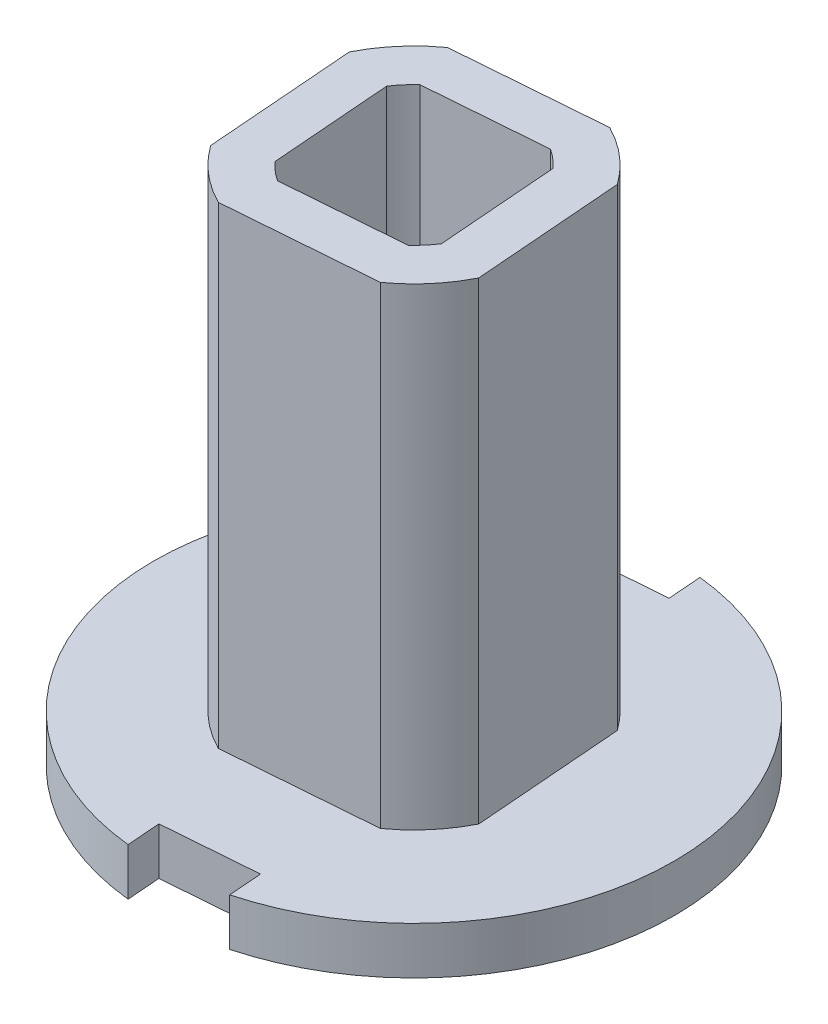
ISO-10303-21;
HEADER;
FILE_DESCRIPTION(('STEP AP214'),'2;1');
FILE_NAME('part.step','',(''),(''),'','','');
FILE_SCHEMA(('AUTOMOTIVE_DESIGN { 1 0 10303 214 1 1 1 1 }'));
ENDSEC;
DATA;
#1=APPLICATION_CONTEXT('core data for automotive mechanical design processes');
#2=APPLICATION_PROTOCOL_DEFINITION('international standard','automotive_design',2000,#1);
#3=PRODUCT_CONTEXT('',#1,'mechanical');
#4=PRODUCT('Part','Part','',(#3));
#5=PRODUCT_RELATED_PRODUCT_CATEGORY('part','',(#4));
#6=PRODUCT_DEFINITION_FORMATION('','',#4);
#7=PRODUCT_DEFINITION_CONTEXT('part definition',#1,'design');
#8=PRODUCT_DEFINITION('design','',#6,#7);
#9=PRODUCT_DEFINITION_SHAPE('','',#8);
#10=(LENGTH_UNIT() NAMED_UNIT(*) SI_UNIT(.MILLI.,.METRE.));
#11=(NAMED_UNIT(*) PLANE_ANGLE_UNIT() SI_UNIT($,.RADIAN.));
#12=(NAMED_UNIT(*) SI_UNIT($,.STERADIAN.) SOLID_ANGLE_UNIT());
#13=UNCERTAINTY_MEASURE_WITH_UNIT(LENGTH_MEASURE(1.E-05),#10,'distance_accuracy_value','');
#14=(GEOMETRIC_REPRESENTATION_CONTEXT(3) GLOBAL_UNCERTAINTY_ASSIGNED_CONTEXT((#13)) GLOBAL_UNIT_ASSIGNED_CONTEXT((#10,
#11,#12)) REPRESENTATION_CONTEXT('',''));
#15=CARTESIAN_POINT('',(0.,0.,0.));
#16=DIRECTION('',(0.,0.,1.));
#17=DIRECTION('',(1.,0.,0.));
#18=AXIS2_PLACEMENT_3D('',#15,#16,#17);
#19=CARTESIAN_POINT('',(0.996970266549163,124.994845223857,-0.0777835947814385));
#20=DIRECTION('',(-0.996970266549047,0.,0.0777835947814291));
#21=DIRECTION('',(0.0777835947814291,0.,0.996970266549047));
#22=AXIS2_PLACEMENT_3D('',#19,#20,#21);
#23=PLANE('',#22);
#24=DIRECTION('',(0.0777835947814291,0.,0.996970266549047));
#25=VECTOR('',#24,1.);
#26=CARTESIAN_POINT('',(0.996970266549163,125.994845223857,-0.0777835947814381));
#27=LINE('',#26,#25);
#28=CARTESIAN_POINT('',(0.576291157487637,125.994845223857,-5.46972471901473));
#29=VERTEX_POINT('',#28);
#30=CARTESIAN_POINT('',(0.631387371076454,125.994845223857,-4.76354384756187));
#31=VERTEX_POINT('',#30);
#32=EDGE_CURVE('E302',#29,#31,#27,.T.);
#33=ORIENTED_EDGE('',*,*,#32,.F.);
#34=DIRECTION('',(0.,1.,0.));
#35=VECTOR('',#34,1.);
#36=CARTESIAN_POINT('',(0.576291157487637,124.994845223857,-5.46972471901473));
#37=LINE('',#36,#35);
#38=CARTESIAN_POINT('',(0.576291157487637,124.994845223857,-5.46972471901473));
#39=VERTEX_POINT('',#38);
#40=EDGE_CURVE('E11',#39,#29,#37,.T.);
#41=ORIENTED_EDGE('',*,*,#40,.F.);
#42=DIRECTION('',(0.0777835947814291,0.,0.996970266549047));
#43=VECTOR('',#42,1.);
#44=CARTESIAN_POINT('',(0.996970266549163,124.994845223857,-0.0777835947814385));
#45=LINE('',#44,#43);
#46=CARTESIAN_POINT('',(0.631387371076454,124.994845223857,-4.76354384756187));
#47=VERTEX_POINT('',#46);
#48=EDGE_CURVE('E335',#39,#47,#45,.T.);
#49=ORIENTED_EDGE('',*,*,#48,.T.);
#50=DIRECTION('',(0.,1.,0.));
#51=VECTOR('',#50,1.);
#52=CARTESIAN_POINT('',(0.631387371076454,124.994845223857,-4.76354384756187));
#53=LINE('',#52,#51);
#54=EDGE_CURVE('E354',#47,#31,#53,.T.);
#55=ORIENTED_EDGE('',*,*,#54,.T.);
#56=EDGE_LOOP('',(#33,#41,#49,#55));
#57=FACE_BOUND('',#56,.T.);
#58=ADVANCED_FACE('F41',(#57),#23,.T.);
#59=CARTESIAN_POINT('',(1.23455057964104E-13,124.994845223857,0.));
#60=DIRECTION('',(0.,1.,0.));
#61=DIRECTION('',(0.,0.,1.));
#62=AXIS2_PLACEMENT_3D('',#59,#60,#61);
#63=CYLINDRICAL_SURFACE('',#62,5.49999999999984);
#64=CARTESIAN_POINT('',(1.2358989284748E-13,125.994845223857,0.));
#65=DIRECTION('',(0.,-1.,0.));
#66=DIRECTION('',(0.,0.,-1.));
#67=AXIS2_PLACEMENT_3D('',#64,#65,#66);
#68=CIRCLE('',#67,5.49999999999984);
#69=CARTESIAN_POINT('',(1.4176493756107,125.994845223857,5.31415752945204));
#70=VERTEX_POINT('',#69);
#71=EDGE_CURVE('E357',#29,#70,#68,.T.);
#72=ORIENTED_EDGE('',*,*,#71,.T.);
#73=DIRECTION('',(0.,1.,0.));
#74=VECTOR('',#73,1.);
#75=CARTESIAN_POINT('',(1.4176493756107,124.994845223857,5.31415752945204));
#76=LINE('',#75,#74);
#77=CARTESIAN_POINT('',(1.4176493756107,124.994845223857,5.31415752945204));
#78=VERTEX_POINT('',#77);
#79=EDGE_CURVE('E48',#78,#70,#76,.T.);
#80=ORIENTED_EDGE('',*,*,#79,.F.);
#81=CARTESIAN_POINT('',(1.23455057964104E-13,124.994845223857,0.));
#82=DIRECTION('',(0.,-1.,0.));
#83=DIRECTION('',(0.,0.,-1.));
#84=AXIS2_PLACEMENT_3D('',#81,#82,#83);
#85=CIRCLE('',#84,5.49999999999984);
#86=EDGE_CURVE('E338',#39,#78,#85,.T.);
#87=ORIENTED_EDGE('',*,*,#86,.F.);
#88=ORIENTED_EDGE('',*,*,#40,.T.);
#89=EDGE_LOOP('',(#72,#80,#87,#88));
#90=FACE_BOUND('',#89,.T.);
#91=ADVANCED_FACE('F425',(#90),#63,.T.);
#92=CARTESIAN_POINT('',(0.996970266549163,124.994845223857,-0.0777835947814384));
#93=DIRECTION('',(0.996970266549047,0.,-0.0777835947814289));
#94=DIRECTION('',(-0.0777835947814289,0.,-0.996970266549047));
#95=AXIS2_PLACEMENT_3D('',#92,#93,#94);
#96=PLANE('',#95);
#97=DIRECTION('',(-0.0777835947814289,0.,-0.996970266549047));
#98=VECTOR('',#97,1.);
#99=CARTESIAN_POINT('',(0.996970266549163,125.994845223857,-0.077783594781438));
#100=LINE('',#99,#98);
#101=CARTESIAN_POINT('',(1.36255316202189,125.994845223857,4.60797665799917));
#102=VERTEX_POINT('',#101);
#103=EDGE_CURVE('E359',#70,#102,#100,.T.);
#104=ORIENTED_EDGE('',*,*,#103,.T.);
#105=DIRECTION('',(0.,1.,0.));
#106=VECTOR('',#105,1.);
#107=CARTESIAN_POINT('',(1.36255316202189,124.994845223857,4.60797665799917));
#108=LINE('',#107,#106);
#109=CARTESIAN_POINT('',(1.36255316202189,124.994845223857,4.60797665799917));
#110=VERTEX_POINT('',#109);
#111=EDGE_CURVE('E384',#110,#102,#108,.T.);
#112=ORIENTED_EDGE('',*,*,#111,.F.);
#113=DIRECTION('',(-0.0777835947814289,0.,-0.996970266549047));
#114=VECTOR('',#113,1.);
#115=CARTESIAN_POINT('',(0.996970266549163,124.994845223857,-0.0777835947814384));
#116=LINE('',#115,#114);
#117=EDGE_CURVE('E341',#78,#110,#116,.T.);
#118=ORIENTED_EDGE('',*,*,#117,.F.);
#119=ORIENTED_EDGE('',*,*,#79,.T.);
#120=EDGE_LOOP('',(#104,#112,#118,#119));
#121=FACE_BOUND('',#120,.T.);
#122=ADVANCED_FACE('F390',(#121),#96,.F.);
#123=CARTESIAN_POINT('',(0.365582895472724,124.994845223857,4.68576025278061));
#124=DIRECTION('',(0.0777835947814291,0.,0.996970266549047));
#125=DIRECTION('',(0.996970266549047,0.,-0.0777835947814291));
#126=AXIS2_PLACEMENT_3D('',#123,#124,#125);
#127=PLANE('',#126);
#128=DIRECTION('',(0.996970266549047,0.,-0.0777835947814291));
#129=VECTOR('',#128,1.);
#130=CARTESIAN_POINT('',(0.365582895472724,125.994845223857,4.68576025278061));
#131=LINE('',#130,#129);
#132=CARTESIAN_POINT('',(-0.631387371076207,125.994845223857,4.76354384756204));
#133=VERTEX_POINT('',#132);
#134=EDGE_CURVE('E363',#133,#102,#131,.T.);
#135=ORIENTED_EDGE('',*,*,#134,.F.);
#136=DIRECTION('',(0.,1.,0.));
#137=VECTOR('',#136,1.);
#138=CARTESIAN_POINT('',(-0.631387371076208,124.994845223857,4.76354384756204));
#139=LINE('',#138,#137);
#140=CARTESIAN_POINT('',(-0.631387371076208,124.994845223857,4.76354384756204));
#141=VERTEX_POINT('',#140);
#142=EDGE_CURVE('E382',#141,#133,#139,.T.);
#143=ORIENTED_EDGE('',*,*,#142,.F.);
#144=DIRECTION('',(0.996970266549047,0.,-0.0777835947814291));
#145=VECTOR('',#144,1.);
#146=CARTESIAN_POINT('',(0.365582895472724,124.994845223857,4.68576025278061));
#147=LINE('',#146,#145);
#148=EDGE_CURVE('E344',#141,#110,#147,.T.);
#149=ORIENTED_EDGE('',*,*,#148,.T.);
#150=ORIENTED_EDGE('',*,*,#111,.T.);
#151=EDGE_LOOP('',(#135,#143,#149,#150));
#152=FACE_BOUND('',#151,.T.);
#153=ADVANCED_FACE('F402',(#152),#127,.T.);
#154=CARTESIAN_POINT('',(-0.996970266548929,124.994845223857,0.077783594781419));
#155=DIRECTION('',(0.996970266549047,0.,-0.0777835947814286));
#156=DIRECTION('',(-0.0777835947814286,0.,-0.996970266549047));
#157=AXIS2_PLACEMENT_3D('',#154,#155,#156);
#158=PLANE('',#157);
#159=DIRECTION('',(-0.0777835947814286,0.,-0.996970266549047));
#160=VECTOR('',#159,1.);
#161=CARTESIAN_POINT('',(-0.996970266548929,125.994845223857,0.0777835947814194));
#162=LINE('',#161,#160);
#163=CARTESIAN_POINT('',(-0.576291157487391,125.994845223857,5.4697247190149));
#164=VERTEX_POINT('',#163);
#165=EDGE_CURVE('E366',#164,#133,#162,.T.);
#166=ORIENTED_EDGE('',*,*,#165,.F.);
#167=DIRECTION('',(0.,1.,0.));
#168=VECTOR('',#167,1.);
#169=CARTESIAN_POINT('',(-0.576291157487391,124.994845223857,5.4697247190149));
#170=LINE('',#169,#168);
#171=CARTESIAN_POINT('',(-0.576291157487391,124.994845223857,5.4697247190149));
#172=VERTEX_POINT('',#171);
#173=EDGE_CURVE('E380',#172,#164,#170,.T.);
#174=ORIENTED_EDGE('',*,*,#173,.F.);
#175=DIRECTION('',(-0.0777835947814286,0.,-0.996970266549047));
#176=VECTOR('',#175,1.);
#177=CARTESIAN_POINT('',(-0.996970266548929,124.994845223857,0.077783594781419));
#178=LINE('',#177,#176);
#179=EDGE_CURVE('E347',#172,#141,#178,.T.);
#180=ORIENTED_EDGE('',*,*,#179,.T.);
#181=ORIENTED_EDGE('',*,*,#142,.T.);
#182=EDGE_LOOP('',(#166,#174,#180,#181));
#183=FACE_BOUND('',#182,.T.);
#184=ADVANCED_FACE('F409',(#183),#158,.T.);
#185=CARTESIAN_POINT('',(-1.41764937561046,125.994845223857,-5.31415752945187));
#186=VERTEX_POINT('',#185);
#187=EDGE_CURVE('E360',#164,#186,#68,.T.);
#188=ORIENTED_EDGE('',*,*,#187,.T.);
#189=DIRECTION('',(0.,1.,0.));
#190=VECTOR('',#189,1.);
#191=CARTESIAN_POINT('',(-1.41764937561046,124.994845223857,-5.31415752945187));
#192=LINE('',#191,#190);
#193=CARTESIAN_POINT('',(-1.41764937561046,124.994845223857,-5.31415752945187));
#194=VERTEX_POINT('',#193);
#195=EDGE_CURVE('E377',#194,#186,#192,.T.);
#196=ORIENTED_EDGE('',*,*,#195,.F.);
#197=EDGE_CURVE('E342',#172,#194,#85,.T.);
#198=ORIENTED_EDGE('',*,*,#197,.F.);
#199=ORIENTED_EDGE('',*,*,#173,.T.);
#200=EDGE_LOOP('',(#188,#196,#198,#199));
#201=FACE_BOUND('',#200,.T.);
#202=ADVANCED_FACE('F413',(#201),#63,.T.);
#203=CARTESIAN_POINT('',(-0.99697026654893,124.994845223857,0.0777835947814197));
#204=DIRECTION('',(-0.996970266549047,0.,0.0777835947814292));
#205=DIRECTION('',(0.0777835947814292,0.,0.996970266549047));
#206=AXIS2_PLACEMENT_3D('',#203,#204,#205);
#207=PLANE('',#206);
#208=DIRECTION('',(0.0777835947814292,0.,0.996970266549047));
#209=VECTOR('',#208,1.);
#210=CARTESIAN_POINT('',(-0.99697026654893,125.994845223857,0.0777835947814201));
#211=LINE('',#210,#209);
#212=CARTESIAN_POINT('',(-1.36255316202164,125.994845223857,-4.60797665799901));
#213=VERTEX_POINT('',#212);
#214=EDGE_CURVE('E369',#186,#213,#211,.T.);
#215=ORIENTED_EDGE('',*,*,#214,.T.);
#216=DIRECTION('',(0.,1.,0.));
#217=VECTOR('',#216,1.);
#218=CARTESIAN_POINT('',(-1.36255316202164,124.994845223857,-4.60797665799901));
#219=LINE('',#218,#217);
#220=CARTESIAN_POINT('',(-1.36255316202164,124.994845223857,-4.60797665799901));
#221=VERTEX_POINT('',#220);
#222=EDGE_CURVE('E374',#221,#213,#219,.T.);
#223=ORIENTED_EDGE('',*,*,#222,.F.);
#224=DIRECTION('',(0.0777835947814292,0.,0.996970266549047));
#225=VECTOR('',#224,1.);
#226=CARTESIAN_POINT('',(-0.99697026654893,124.994845223857,0.0777835947814197));
#227=LINE('',#226,#225);
#228=EDGE_CURVE('E350',#194,#221,#227,.T.);
#229=ORIENTED_EDGE('',*,*,#228,.F.);
#230=ORIENTED_EDGE('',*,*,#195,.T.);
#231=EDGE_LOOP('',(#215,#223,#229,#230));
#232=FACE_BOUND('',#231,.T.);
#233=ADVANCED_FACE('F419',(#232),#207,.F.);
#234=CARTESIAN_POINT('',(-0.36558289547271,124.994845223857,-4.68576025278043));
#235=DIRECTION('',(0.0777835947814291,0.,0.996970266549047));
#236=DIRECTION('',(0.996970266549047,0.,-0.0777835947814291));
#237=AXIS2_PLACEMENT_3D('',#234,#235,#236);
#238=PLANE('',#237);
#239=DIRECTION('',(0.996970266549047,0.,-0.0777835947814291));
#240=VECTOR('',#239,1.);
#241=CARTESIAN_POINT('',(-0.36558289547271,125.994845223857,-4.68576025278043));
#242=LINE('',#241,#240);
#243=EDGE_CURVE('E339',#213,#31,#242,.T.);
#244=ORIENTED_EDGE('',*,*,#243,.T.);
#245=ORIENTED_EDGE('',*,*,#54,.F.);
#246=DIRECTION('',(0.996970266549047,0.,-0.0777835947814291));
#247=VECTOR('',#246,1.);
#248=CARTESIAN_POINT('',(-0.36558289547271,124.994845223857,-4.68576025278043));
#249=LINE('',#248,#247);
#250=EDGE_CURVE('E352',#221,#47,#249,.T.);
#251=ORIENTED_EDGE('',*,*,#250,.F.);
#252=ORIENTED_EDGE('',*,*,#222,.T.);
#253=EDGE_LOOP('',(#244,#245,#251,#252));
#254=FACE_BOUND('',#253,.T.);
#255=ADVANCED_FACE('F423',(#254),#238,.F.);
#256=CARTESIAN_POINT('',(0.,124.994845223857,0.));
#257=DIRECTION('',(0.,-1.,0.));
#258=DIRECTION('',(0.,0.,-1.));
#259=AXIS2_PLACEMENT_3D('',#256,#257,#258);
#260=PLANE('',#259);
#261=ORIENTED_EDGE('',*,*,#48,.F.);
#262=ORIENTED_EDGE('',*,*,#86,.T.);
#263=ORIENTED_EDGE('',*,*,#117,.T.);
#264=ORIENTED_EDGE('',*,*,#148,.F.);
#265=ORIENTED_EDGE('',*,*,#179,.F.);
#266=ORIENTED_EDGE('',*,*,#197,.T.);
#267=ORIENTED_EDGE('',*,*,#228,.T.);
#268=ORIENTED_EDGE('',*,*,#250,.T.);
#269=EDGE_LOOP('',(#261,#262,#263,#264,#265,#266,#267,#268));
#270=FACE_BOUND('',#269,.T.);
#271=ADVANCED_FACE('F407',(#270),#260,.T.);
#272=CARTESIAN_POINT('',(0.,125.994845223857,0.));
#273=DIRECTION('',(0.,-1.,0.));
#274=DIRECTION('',(0.,0.,-1.));
#275=AXIS2_PLACEMENT_3D('',#272,#273,#274);
#276=PLANE('',#275);
#277=CARTESIAN_POINT('',(1.2358989284748E-13,125.994845223857,0.));
#278=DIRECTION('',(0.,-1.,0.));
#279=DIRECTION('',(0.,0.,-1.));
#280=AXIS2_PLACEMENT_3D('',#277,#278,#279);
#281=CIRCLE('',#280,3.082);
#282=CARTESIAN_POINT('',(-1.38447968775225,125.994845223857,2.75353227585978));
#283=VERTEX_POINT('',#282);
#284=CARTESIAN_POINT('',(-2.5054858801864,125.994845223857,1.79478815022449));
#285=VERTEX_POINT('',#284);
#286=EDGE_CURVE('E223',#283,#285,#281,.T.);
#287=ORIENTED_EDGE('',*,*,#286,.T.);
#288=DIRECTION('',(-0.0777835947814289,0.,-0.996970266549047));
#289=VECTOR('',#288,1.);
#290=CARTESIAN_POINT('',(-2.629509078023,125.994845223857,0.20515423123601));
#291=LINE('',#290,#289);
#292=CARTESIAN_POINT('',(-2.75353227585958,125.994845223857,-1.38447968775229));
#293=VERTEX_POINT('',#292);
#294=EDGE_CURVE('E280',#285,#293,#291,.T.);
#295=ORIENTED_EDGE('',*,*,#294,.T.);
#296=CARTESIAN_POINT('',(1.2358989284748E-13,125.994845223857,0.));
#297=DIRECTION('',(0.,-1.,0.));
#298=DIRECTION('',(0.,0.,-1.));
#299=AXIS2_PLACEMENT_3D('',#296,#297,#298);
#300=CIRCLE('',#299,3.082);
#301=CARTESIAN_POINT('',(-1.79478815022429,125.994845223857,-2.50548588018644));
#302=VERTEX_POINT('',#301);
#303=EDGE_CURVE('E283',#293,#302,#300,.T.);
#304=ORIENTED_EDGE('',*,*,#303,.T.);
#305=DIRECTION('',(0.996970266549047,0.,-0.077783594781429));
#306=VECTOR('',#305,1.);
#307=CARTESIAN_POINT('',(-0.205154231236012,125.994845223857,-2.62950907802302));
#308=LINE('',#307,#306);
#309=CARTESIAN_POINT('',(1.38447968775249,125.994845223857,-2.75353227585962));
#310=VERTEX_POINT('',#309);
#311=EDGE_CURVE('E286',#302,#310,#308,.T.);
#312=ORIENTED_EDGE('',*,*,#311,.T.);
#313=CARTESIAN_POINT('',(1.2358989284748E-13,125.994845223857,0.));
#314=DIRECTION('',(0.,-1.,0.));
#315=DIRECTION('',(0.,0.,-1.));
#316=AXIS2_PLACEMENT_3D('',#313,#314,#315);
#317=CIRCLE('',#316,3.082);
#318=CARTESIAN_POINT('',(2.50548588018665,125.994845223857,-1.79478815022433));
#319=VERTEX_POINT('',#318);
#320=EDGE_CURVE('E289',#310,#319,#317,.T.);
#321=ORIENTED_EDGE('',*,*,#320,.T.);
#322=DIRECTION('',(0.0777835947814297,0.,0.996970266549047));
#323=VECTOR('',#322,1.);
#324=CARTESIAN_POINT('',(2.62950907802323,125.994845223857,-0.20515423123603));
#325=LINE('',#324,#323);
#326=CARTESIAN_POINT('',(2.75353227585982,125.994845223857,1.38447968775245));
#327=VERTEX_POINT('',#326);
#328=EDGE_CURVE('E292',#319,#327,#325,.T.);
#329=ORIENTED_EDGE('',*,*,#328,.T.);
#330=CARTESIAN_POINT('',(1.2358989284748E-13,125.994845223857,0.));
#331=DIRECTION('',(0.,-1.,0.));
#332=DIRECTION('',(0.,0.,-1.));
#333=AXIS2_PLACEMENT_3D('',#330,#331,#332);
#334=CIRCLE('',#333,3.082);
#335=CARTESIAN_POINT('',(1.79478815022453,125.994845223857,2.50548588018661));
#336=VERTEX_POINT('',#335);
#337=EDGE_CURVE('E295',#327,#336,#334,.T.);
#338=ORIENTED_EDGE('',*,*,#337,.T.);
#339=DIRECTION('',(-0.996970266549047,0.,0.0777835947814291));
#340=VECTOR('',#339,1.);
#341=CARTESIAN_POINT('',(0.205154231236026,125.994845223857,2.6295090780232));
#342=LINE('',#341,#340);
#343=EDGE_CURVE('E226',#336,#283,#342,.T.);
#344=ORIENTED_EDGE('',*,*,#343,.T.);
#345=EDGE_LOOP('',(#287,#295,#304,#312,#321,#329,#338,#344));
#346=FACE_BOUND('',#345,.T.);
#347=ORIENTED_EDGE('',*,*,#32,.T.);
#348=ORIENTED_EDGE('',*,*,#243,.F.);
#349=ORIENTED_EDGE('',*,*,#214,.F.);
#350=ORIENTED_EDGE('',*,*,#187,.F.);
#351=ORIENTED_EDGE('',*,*,#165,.T.);
#352=ORIENTED_EDGE('',*,*,#134,.T.);
#353=ORIENTED_EDGE('',*,*,#103,.F.);
#354=ORIENTED_EDGE('',*,*,#71,.F.);
#355=EDGE_LOOP('',(#347,#348,#349,#350,#351,#352,#353,#354));
#356=FACE_BOUND('',#355,.T.);
#357=ADVANCED_FACE('F396',(#346,#356),#276,.F.);
#358=CARTESIAN_POINT('',(-2.62950907802299,135.994845223857,0.205154231236014));
#359=DIRECTION('',(-0.996970266549047,0.,0.0777835947814289));
#360=DIRECTION('',(0.0777835947814289,0.,0.996970266549047));
#361=AXIS2_PLACEMENT_3D('',#358,#359,#360);
#362=PLANE('',#361);
#363=ORIENTED_EDGE('',*,*,#294,.F.);
#364=DIRECTION('',(0.,-1.,0.));
#365=VECTOR('',#364,1.);
#366=CARTESIAN_POINT('',(-2.5054858801864,135.994845223857,1.7947881502245));
#367=LINE('',#366,#365);
#368=CARTESIAN_POINT('',(-2.5054858801864,135.994845223857,1.7947881502245));
#369=VERTEX_POINT('',#368);
#370=EDGE_CURVE('E300',#369,#285,#367,.T.);
#371=ORIENTED_EDGE('',*,*,#370,.F.);
#372=DIRECTION('',(-0.0777835947814289,0.,-0.996970266549047));
#373=VECTOR('',#372,1.);
#374=CARTESIAN_POINT('',(-2.62950907802299,135.994845223857,0.205154231236014));
#375=LINE('',#374,#373);
#376=CARTESIAN_POINT('',(-2.75353227585957,135.994845223857,-1.38447968775229));
#377=VERTEX_POINT('',#376);
#378=EDGE_CURVE('E240',#369,#377,#375,.T.);
#379=ORIENTED_EDGE('',*,*,#378,.T.);
#380=DIRECTION('',(0.,-1.,0.));
#381=VECTOR('',#380,1.);
#382=CARTESIAN_POINT('',(-2.75353227585957,135.994845223857,-1.38447968775229));
#383=LINE('',#382,#381);
#384=EDGE_CURVE('E316',#377,#293,#383,.T.);
#385=ORIENTED_EDGE('',*,*,#384,.T.);
#386=EDGE_LOOP('',(#363,#371,#379,#385));
#387=FACE_BOUND('',#386,.T.);
#388=ADVANCED_FACE('F497',(#387),#362,.T.);
#389=CARTESIAN_POINT('',(1.24938241681235E-13,135.994845223857,0.));
#390=DIRECTION('',(0.,-1.,0.));
#391=DIRECTION('',(0.,0.,-1.));
#392=AXIS2_PLACEMENT_3D('',#389,#390,#391);
#393=CYLINDRICAL_SURFACE('',#392,3.082);
#394=ORIENTED_EDGE('',*,*,#286,.F.);
#395=DIRECTION('',(0.,-1.,0.));
#396=VECTOR('',#395,1.);
#397=CARTESIAN_POINT('',(-1.38447968775224,135.994845223857,2.75353227585979));
#398=LINE('',#397,#396);
#399=CARTESIAN_POINT('',(-1.38447968775224,135.994845223857,2.75353227585979));
#400=VERTEX_POINT('',#399);
#401=EDGE_CURVE('E303',#400,#283,#398,.T.);
#402=ORIENTED_EDGE('',*,*,#401,.F.);
#403=CARTESIAN_POINT('',(1.24938241681235E-13,135.994845223857,0.));
#404=DIRECTION('',(0.,-1.,0.));
#405=DIRECTION('',(0.,0.,-1.));
#406=AXIS2_PLACEMENT_3D('',#403,#404,#405);
#407=CIRCLE('',#406,3.082);
#408=EDGE_CURVE('E219',#400,#369,#407,.T.);
#409=ORIENTED_EDGE('',*,*,#408,.T.);
#410=ORIENTED_EDGE('',*,*,#370,.T.);
#411=EDGE_LOOP('',(#394,#402,#409,#410));
#412=FACE_BOUND('',#411,.T.);
#413=ADVANCED_FACE('F513',(#412),#393,.T.);
#414=CARTESIAN_POINT('',(0.205154231236028,135.994845223857,2.62950907802321));
#415=DIRECTION('',(0.0777835947814291,0.,0.996970266549047));
#416=DIRECTION('',(0.996970266549047,0.,-0.0777835947814291));
#417=AXIS2_PLACEMENT_3D('',#414,#415,#416);
#418=PLANE('',#417);
#419=ORIENTED_EDGE('',*,*,#343,.F.);
#420=DIRECTION('',(0.,-1.,0.));
#421=VECTOR('',#420,1.);
#422=CARTESIAN_POINT('',(1.79478815022453,135.994845223857,2.50548588018661));
#423=LINE('',#422,#421);
#424=CARTESIAN_POINT('',(1.79478815022453,135.994845223857,2.50548588018661));
#425=VERTEX_POINT('',#424);
#426=EDGE_CURVE('E305',#425,#336,#423,.T.);
#427=ORIENTED_EDGE('',*,*,#426,.F.);
#428=DIRECTION('',(-0.996970266549047,0.,0.0777835947814291));
#429=VECTOR('',#428,1.);
#430=CARTESIAN_POINT('',(0.205154231236028,135.994845223857,2.62950907802321));
#431=LINE('',#430,#429);
#432=EDGE_CURVE('E258',#425,#400,#431,.T.);
#433=ORIENTED_EDGE('',*,*,#432,.T.);
#434=ORIENTED_EDGE('',*,*,#401,.T.);
#435=EDGE_LOOP('',(#419,#427,#433,#434));
#436=FACE_BOUND('',#435,.T.);
#437=ADVANCED_FACE('F523',(#436),#418,.T.);
#438=CARTESIAN_POINT('',(1.24938241681235E-13,135.994845223857,0.));
#439=DIRECTION('',(0.,-1.,0.));
#440=DIRECTION('',(0.,0.,-1.));
#441=AXIS2_PLACEMENT_3D('',#438,#439,#440);
#442=CYLINDRICAL_SURFACE('',#441,3.082);
#443=ORIENTED_EDGE('',*,*,#337,.F.);
#444=DIRECTION('',(0.,-1.,0.));
#445=VECTOR('',#444,1.);
#446=CARTESIAN_POINT('',(2.75353227585983,135.994845223857,1.38447968775246));
#447=LINE('',#446,#445);
#448=CARTESIAN_POINT('',(2.75353227585983,135.994845223857,1.38447968775246));
#449=VERTEX_POINT('',#448);
#450=EDGE_CURVE('E307',#449,#327,#447,.T.);
#451=ORIENTED_EDGE('',*,*,#450,.F.);
#452=CARTESIAN_POINT('',(1.24938241681235E-13,135.994845223857,0.));
#453=DIRECTION('',(0.,-1.,0.));
#454=DIRECTION('',(0.,0.,-1.));
#455=AXIS2_PLACEMENT_3D('',#452,#453,#454);
#456=CIRCLE('',#455,3.082);
#457=EDGE_CURVE('E255',#449,#425,#456,.T.);
#458=ORIENTED_EDGE('',*,*,#457,.T.);
#459=ORIENTED_EDGE('',*,*,#426,.T.);
#460=EDGE_LOOP('',(#443,#451,#458,#459));
#461=FACE_BOUND('',#460,.T.);
#462=ADVANCED_FACE('F532',(#461),#442,.T.);
#463=CARTESIAN_POINT('',(2.62950907802323,135.994845223857,-0.205154231236026));
#464=DIRECTION('',(0.996970266549047,0.,-0.0777835947814297));
#465=DIRECTION('',(-0.0777835947814297,0.,-0.996970266549047));
#466=AXIS2_PLACEMENT_3D('',#463,#464,#465);
#467=PLANE('',#466);
#468=ORIENTED_EDGE('',*,*,#328,.F.);
#469=DIRECTION('',(0.,-1.,0.));
#470=VECTOR('',#469,1.);
#471=CARTESIAN_POINT('',(2.50548588018665,135.994845223857,-1.79478815022432));
#472=LINE('',#471,#470);
#473=CARTESIAN_POINT('',(2.50548588018665,135.994845223857,-1.79478815022432));
#474=VERTEX_POINT('',#473);
#475=EDGE_CURVE('E309',#474,#319,#472,.T.);
#476=ORIENTED_EDGE('',*,*,#475,.F.);
#477=DIRECTION('',(0.0777835947814297,0.,0.996970266549047));
#478=VECTOR('',#477,1.);
#479=CARTESIAN_POINT('',(2.62950907802323,135.994845223857,-0.205154231236026));
#480=LINE('',#479,#478);
#481=EDGE_CURVE('E252',#474,#449,#480,.T.);
#482=ORIENTED_EDGE('',*,*,#481,.T.);
#483=ORIENTED_EDGE('',*,*,#450,.T.);
#484=EDGE_LOOP('',(#468,#476,#482,#483));
#485=FACE_BOUND('',#484,.T.);
#486=ADVANCED_FACE('F541',(#485),#467,.T.);
#487=CARTESIAN_POINT('',(1.24938241681235E-13,135.994845223857,0.));
#488=DIRECTION('',(0.,-1.,0.));
#489=DIRECTION('',(0.,0.,-1.));
#490=AXIS2_PLACEMENT_3D('',#487,#488,#489);
#491=CYLINDRICAL_SURFACE('',#490,3.082);
#492=ORIENTED_EDGE('',*,*,#320,.F.);
#493=DIRECTION('',(0.,-1.,0.));
#494=VECTOR('',#493,1.);
#495=CARTESIAN_POINT('',(1.3844796877525,135.994845223857,-2.75353227585961));
#496=LINE('',#495,#494);
#497=CARTESIAN_POINT('',(1.3844796877525,135.994845223857,-2.75353227585961));
#498=VERTEX_POINT('',#497);
#499=EDGE_CURVE('E311',#498,#310,#496,.T.);
#500=ORIENTED_EDGE('',*,*,#499,.F.);
#501=CARTESIAN_POINT('',(1.24938241681235E-13,135.994845223857,0.));
#502=DIRECTION('',(0.,-1.,0.));
#503=DIRECTION('',(0.,0.,-1.));
#504=AXIS2_PLACEMENT_3D('',#501,#502,#503);
#505=CIRCLE('',#504,3.082);
#506=EDGE_CURVE('E249',#498,#474,#505,.T.);
#507=ORIENTED_EDGE('',*,*,#506,.T.);
#508=ORIENTED_EDGE('',*,*,#475,.T.);
#509=EDGE_LOOP('',(#492,#500,#507,#508));
#510=FACE_BOUND('',#509,.T.);
#511=ADVANCED_FACE('F550',(#510),#491,.T.);
#512=CARTESIAN_POINT('',(-0.205154231236011,135.994845223857,-2.62950907802302));
#513=DIRECTION('',(-0.077783594781429,0.,-0.996970266549047));
#514=DIRECTION('',(-0.996970266549047,0.,0.077783594781429));
#515=AXIS2_PLACEMENT_3D('',#512,#513,#514);
#516=PLANE('',#515);
#517=ORIENTED_EDGE('',*,*,#311,.F.);
#518=DIRECTION('',(0.,-1.,0.));
#519=VECTOR('',#518,1.);
#520=CARTESIAN_POINT('',(-1.79478815022428,135.994845223857,-2.50548588018644));
#521=LINE('',#520,#519);
#522=CARTESIAN_POINT('',(-1.79478815022428,135.994845223857,-2.50548588018644));
#523=VERTEX_POINT('',#522);
#524=EDGE_CURVE('E313',#523,#302,#521,.T.);
#525=ORIENTED_EDGE('',*,*,#524,.F.);
#526=DIRECTION('',(0.996970266549047,0.,-0.077783594781429));
#527=VECTOR('',#526,1.);
#528=CARTESIAN_POINT('',(-0.205154231236011,135.994845223857,-2.62950907802302));
#529=LINE('',#528,#527);
#530=EDGE_CURVE('E246',#523,#498,#529,.T.);
#531=ORIENTED_EDGE('',*,*,#530,.T.);
#532=ORIENTED_EDGE('',*,*,#499,.T.);
#533=EDGE_LOOP('',(#517,#525,#531,#532));
#534=FACE_BOUND('',#533,.T.);
#535=ADVANCED_FACE('F560',(#534),#516,.T.);
#536=CARTESIAN_POINT('',(1.24938241681235E-13,135.994845223857,0.));
#537=DIRECTION('',(0.,-1.,0.));
#538=DIRECTION('',(0.,0.,-1.));
#539=AXIS2_PLACEMENT_3D('',#536,#537,#538);
#540=CYLINDRICAL_SURFACE('',#539,2.082);
#541=CARTESIAN_POINT('',(1.2358989284748E-13,125.994845223857,0.));
#542=DIRECTION('',(0.,-1.,0.));
#543=DIRECTION('',(0.,0.,-1.));
#544=AXIS2_PLACEMENT_3D('',#541,#542,#543);
#545=CIRCLE('',#544,2.082);
#546=CARTESIAN_POINT('',(1.15454773149648,125.994845223857,-1.7325540498629));
#547=VERTEX_POINT('',#546);
#548=CARTESIAN_POINT('',(1.53252357308527,125.994845223857,-1.40928900440545));
#549=VERTEX_POINT('',#548);
#550=EDGE_CURVE('E263',#547,#549,#545,.T.);
#551=ORIENTED_EDGE('',*,*,#550,.T.);
#552=DIRECTION('',(0.,-1.,0.));
#553=VECTOR('',#552,1.);
#554=CARTESIAN_POINT('',(1.53252357308527,135.994845223857,-1.40928900440545));
#555=LINE('',#554,#553);
#556=CARTESIAN_POINT('',(1.53252357308527,135.994845223857,-1.40928900440545));
#557=VERTEX_POINT('',#556);
#558=EDGE_CURVE('E222',#557,#549,#555,.T.);
#559=ORIENTED_EDGE('',*,*,#558,.F.);
#560=CARTESIAN_POINT('',(1.24938241681235E-13,135.994845223857,0.));
#561=DIRECTION('',(0.,-1.,0.));
#562=DIRECTION('',(0.,0.,-1.));
#563=AXIS2_PLACEMENT_3D('',#560,#561,#562);
#564=CIRCLE('',#563,2.082);
#565=CARTESIAN_POINT('',(1.15454773149648,135.994845223857,-1.7325540498629));
#566=VERTEX_POINT('',#565);
#567=EDGE_CURVE('E203',#566,#557,#564,.T.);
#568=ORIENTED_EDGE('',*,*,#567,.F.);
#569=DIRECTION('',(0.,-1.,0.));
#570=VECTOR('',#569,1.);
#571=CARTESIAN_POINT('',(1.15454773149648,135.994845223857,-1.7325540498629));
#572=LINE('',#571,#570);
#573=EDGE_CURVE('E213',#566,#547,#572,.T.);
#574=ORIENTED_EDGE('',*,*,#573,.T.);
#575=EDGE_LOOP('',(#551,#559,#568,#574));
#576=FACE_BOUND('',#575,.T.);
#577=ADVANCED_FACE('F221',(#576),#540,.F.);
#578=CARTESIAN_POINT('',(1.63253881147418,135.994845223857,-0.127370636454595));
#579=DIRECTION('',(0.996970266549047,0.,-0.0777835947814292));
#580=DIRECTION('',(-0.0777835947814292,0.,-0.996970266549047));
#581=AXIS2_PLACEMENT_3D('',#578,#579,#580);
#582=PLANE('',#581);
#583=DIRECTION('',(0.0777835947814292,0.,0.996970266549047));
#584=VECTOR('',#583,1.);
#585=CARTESIAN_POINT('',(1.63253881147418,125.994845223857,-0.127370636454599));
#586=LINE('',#585,#584);
#587=CARTESIAN_POINT('',(1.73255404986311,125.994845223857,1.15454773149643));
#588=VERTEX_POINT('',#587);
#589=EDGE_CURVE('E55',#549,#588,#586,.T.);
#590=ORIENTED_EDGE('',*,*,#589,.T.);
#591=DIRECTION('',(0.,-1.,0.));
#592=VECTOR('',#591,1.);
#593=CARTESIAN_POINT('',(1.73255404986311,135.994845223857,1.15454773149644));
#594=LINE('',#593,#592);
#595=CARTESIAN_POINT('',(1.73255404986311,135.994845223857,1.15454773149644));
#596=VERTEX_POINT('',#595);
#597=EDGE_CURVE('E319',#596,#588,#594,.T.);
#598=ORIENTED_EDGE('',*,*,#597,.F.);
#599=DIRECTION('',(0.0777835947814292,0.,0.996970266549047));
#600=VECTOR('',#599,1.);
#601=CARTESIAN_POINT('',(1.63253881147418,135.994845223857,-0.127370636454595));
#602=LINE('',#601,#600);
#603=EDGE_CURVE('E238',#557,#596,#602,.T.);
#604=ORIENTED_EDGE('',*,*,#603,.F.);
#605=ORIENTED_EDGE('',*,*,#558,.T.);
#606=EDGE_LOOP('',(#590,#598,#604,#605));
#607=FACE_BOUND('',#606,.T.);
#608=ADVANCED_FACE('F577',(#607),#582,.F.);
#609=CARTESIAN_POINT('',(1.24938241681235E-13,135.994845223857,0.));
#610=DIRECTION('',(0.,-1.,0.));
#611=DIRECTION('',(0.,0.,-1.));
#612=AXIS2_PLACEMENT_3D('',#609,#610,#611);
#613=CYLINDRICAL_SURFACE('',#612,2.082);
#614=CARTESIAN_POINT('',(1.2358989284748E-13,125.994845223857,0.));
#615=DIRECTION('',(0.,-1.,0.));
#616=DIRECTION('',(0.,0.,-1.));
#617=AXIS2_PLACEMENT_3D('',#614,#615,#616);
#618=CIRCLE('',#617,2.082);
#619=CARTESIAN_POINT('',(1.40928900440566,125.994845223857,1.53252357308523));
#620=VERTEX_POINT('',#619);
#621=EDGE_CURVE('E60',#588,#620,#618,.T.);
#622=ORIENTED_EDGE('',*,*,#621,.T.);
#623=DIRECTION('',(0.,-1.,0.));
#624=VECTOR('',#623,1.);
#625=CARTESIAN_POINT('',(1.40928900440566,135.994845223857,1.53252357308523));
#626=LINE('',#625,#624);
#627=CARTESIAN_POINT('',(1.40928900440566,135.994845223857,1.53252357308523));
#628=VERTEX_POINT('',#627);
#629=EDGE_CURVE('E322',#628,#620,#626,.T.);
#630=ORIENTED_EDGE('',*,*,#629,.F.);
#631=CARTESIAN_POINT('',(1.24938241681235E-13,135.994845223857,0.));
#632=DIRECTION('',(0.,-1.,0.));
#633=DIRECTION('',(0.,0.,-1.));
#634=AXIS2_PLACEMENT_3D('',#631,#632,#633);
#635=CIRCLE('',#634,2.082);
#636=EDGE_CURVE('E236',#596,#628,#635,.T.);
#637=ORIENTED_EDGE('',*,*,#636,.F.);
#638=ORIENTED_EDGE('',*,*,#597,.T.);
#639=EDGE_LOOP('',(#622,#630,#637,#638));
#640=FACE_BOUND('',#639,.T.);
#641=ADVANCED_FACE('F585',(#640),#613,.F.);
#642=CARTESIAN_POINT('',(0.127370636454599,135.994845223857,1.63253881147416));
#643=DIRECTION('',(0.0777835947814291,0.,0.996970266549047));
#644=DIRECTION('',(0.996970266549047,0.,-0.0777835947814291));
#645=AXIS2_PLACEMENT_3D('',#642,#643,#644);
#646=PLANE('',#645);
#647=DIRECTION('',(-0.996970266549047,0.,0.0777835947814291));
#648=VECTOR('',#647,1.);
#649=CARTESIAN_POINT('',(0.127370636454597,125.994845223857,1.63253881147416));
#650=LINE('',#649,#648);
#651=CARTESIAN_POINT('',(-1.15454773149623,125.994845223857,1.73255404986307));
#652=VERTEX_POINT('',#651);
#653=EDGE_CURVE('E275',#620,#652,#650,.T.);
#654=ORIENTED_EDGE('',*,*,#653,.T.);
#655=DIRECTION('',(0.,-1.,0.));
#656=VECTOR('',#655,1.);
#657=CARTESIAN_POINT('',(-1.15454773149623,135.994845223857,1.73255404986307));
#658=LINE('',#657,#656);
#659=CARTESIAN_POINT('',(-1.15454773149623,135.994845223857,1.73255404986307));
#660=VERTEX_POINT('',#659);
#661=EDGE_CURVE('E325',#660,#652,#658,.T.);
#662=ORIENTED_EDGE('',*,*,#661,.F.);
#663=DIRECTION('',(-0.996970266549047,0.,0.0777835947814291));
#664=VECTOR('',#663,1.);
#665=CARTESIAN_POINT('',(0.127370636454599,135.994845223857,1.63253881147416));
#666=LINE('',#665,#664);
#667=EDGE_CURVE('E234',#628,#660,#666,.T.);
#668=ORIENTED_EDGE('',*,*,#667,.F.);
#669=ORIENTED_EDGE('',*,*,#629,.T.);
#670=EDGE_LOOP('',(#654,#662,#668,#669));
#671=FACE_BOUND('',#670,.T.);
#672=ADVANCED_FACE('F595',(#671),#646,.F.);
#673=CARTESIAN_POINT('',(1.24938241681235E-13,135.994845223857,0.));
#674=DIRECTION('',(0.,-1.,0.));
#675=DIRECTION('',(0.,0.,-1.));
#676=AXIS2_PLACEMENT_3D('',#673,#674,#675);
#677=CYLINDRICAL_SURFACE('',#676,2.082);
#678=CARTESIAN_POINT('',(1.2358989284748E-13,125.994845223857,0.));
#679=DIRECTION('',(0.,-1.,0.));
#680=DIRECTION('',(0.,0.,-1.));
#681=AXIS2_PLACEMENT_3D('',#678,#679,#680);
#682=CIRCLE('',#681,2.082);
#683=CARTESIAN_POINT('',(-1.53252357308502,125.994845223857,1.40928900440562));
#684=VERTEX_POINT('',#683);
#685=EDGE_CURVE('E272',#652,#684,#682,.T.);
#686=ORIENTED_EDGE('',*,*,#685,.T.);
#687=DIRECTION('',(0.,-1.,0.));
#688=VECTOR('',#687,1.);
#689=CARTESIAN_POINT('',(-1.53252357308502,135.994845223857,1.40928900440562));
#690=LINE('',#689,#688);
#691=CARTESIAN_POINT('',(-1.53252357308502,135.994845223857,1.40928900440562));
#692=VERTEX_POINT('',#691);
#693=EDGE_CURVE('E328',#692,#684,#690,.T.);
#694=ORIENTED_EDGE('',*,*,#693,.F.);
#695=CARTESIAN_POINT('',(1.24938241681235E-13,135.994845223857,0.));
#696=DIRECTION('',(0.,-1.,0.));
#697=DIRECTION('',(0.,0.,-1.));
#698=AXIS2_PLACEMENT_3D('',#695,#696,#697);
#699=CIRCLE('',#698,2.082);
#700=EDGE_CURVE('E232',#660,#692,#699,.T.);
#701=ORIENTED_EDGE('',*,*,#700,.F.);
#702=ORIENTED_EDGE('',*,*,#661,.T.);
#703=EDGE_LOOP('',(#686,#694,#701,#702));
#704=FACE_BOUND('',#703,.T.);
#705=ADVANCED_FACE('F604',(#704),#677,.F.);
#706=CARTESIAN_POINT('',(-1.63253881147395,135.994845223857,0.127370636454585));
#707=DIRECTION('',(-0.996970266549047,0.,0.0777835947814292));
#708=DIRECTION('',(0.0777835947814292,0.,0.996970266549047));
#709=AXIS2_PLACEMENT_3D('',#706,#707,#708);
#710=PLANE('',#709);
#711=DIRECTION('',(-0.0777835947814292,0.,-0.996970266549047));
#712=VECTOR('',#711,1.);
#713=CARTESIAN_POINT('',(-1.63253881147395,125.994845223857,0.127370636454581));
#714=LINE('',#713,#712);
#715=CARTESIAN_POINT('',(-1.73255404986286,125.994845223857,-1.15454773149627));
#716=VERTEX_POINT('',#715);
#717=EDGE_CURVE('E269',#684,#716,#714,.T.);
#718=ORIENTED_EDGE('',*,*,#717,.T.);
#719=DIRECTION('',(0.,-1.,0.));
#720=VECTOR('',#719,1.);
#721=CARTESIAN_POINT('',(-1.73255404986286,135.994845223857,-1.15454773149627));
#722=LINE('',#721,#720);
#723=CARTESIAN_POINT('',(-1.73255404986286,135.994845223857,-1.15454773149627));
#724=VERTEX_POINT('',#723);
#725=EDGE_CURVE('E331',#724,#716,#722,.T.);
#726=ORIENTED_EDGE('',*,*,#725,.F.);
#727=DIRECTION('',(-0.0777835947814292,0.,-0.996970266549047));
#728=VECTOR('',#727,1.);
#729=CARTESIAN_POINT('',(-1.63253881147395,135.994845223857,0.127370636454585));
#730=LINE('',#729,#728);
#731=EDGE_CURVE('E230',#692,#724,#730,.T.);
#732=ORIENTED_EDGE('',*,*,#731,.F.);
#733=ORIENTED_EDGE('',*,*,#693,.T.);
#734=EDGE_LOOP('',(#718,#726,#732,#733));
#735=FACE_BOUND('',#734,.T.);
#736=ADVANCED_FACE('F613',(#735),#710,.F.);
#737=CARTESIAN_POINT('',(1.24938241681235E-13,135.994845223857,0.));
#738=DIRECTION('',(0.,-1.,0.));
#739=DIRECTION('',(0.,0.,-1.));
#740=AXIS2_PLACEMENT_3D('',#737,#738,#739);
#741=CYLINDRICAL_SURFACE('',#740,2.082);
#742=CARTESIAN_POINT('',(1.2358989284748E-13,125.994845223857,0.));
#743=DIRECTION('',(0.,-1.,0.));
#744=DIRECTION('',(0.,0.,-1.));
#745=AXIS2_PLACEMENT_3D('',#742,#743,#744);
#746=CIRCLE('',#745,2.082);
#747=CARTESIAN_POINT('',(-1.40928900440541,125.994845223857,-1.53252357308506));
#748=VERTEX_POINT('',#747);
#749=EDGE_CURVE('E266',#716,#748,#746,.T.);
#750=ORIENTED_EDGE('',*,*,#749,.T.);
#751=DIRECTION('',(0.,-1.,0.));
#752=VECTOR('',#751,1.);
#753=CARTESIAN_POINT('',(-1.40928900440541,135.994845223857,-1.53252357308506));
#754=LINE('',#753,#752);
#755=CARTESIAN_POINT('',(-1.40928900440541,135.994845223857,-1.53252357308506));
#756=VERTEX_POINT('',#755);
#757=EDGE_CURVE('E218',#756,#748,#754,.T.);
#758=ORIENTED_EDGE('',*,*,#757,.F.);
#759=CARTESIAN_POINT('',(1.24938241681235E-13,135.994845223857,0.));
#760=DIRECTION('',(0.,-1.,0.));
#761=DIRECTION('',(0.,0.,-1.));
#762=AXIS2_PLACEMENT_3D('',#759,#760,#761);
#763=CIRCLE('',#762,2.082);
#764=EDGE_CURVE('E206',#724,#756,#763,.T.);
#765=ORIENTED_EDGE('',*,*,#764,.F.);
#766=ORIENTED_EDGE('',*,*,#725,.T.);
#767=EDGE_LOOP('',(#750,#758,#765,#766));
#768=FACE_BOUND('',#767,.T.);
#769=ADVANCED_FACE('F622',(#768),#741,.F.);
#770=CARTESIAN_POINT('',(-0.127370636454582,135.994845223857,-1.63253881147397));
#771=DIRECTION('',(-0.0777835947814291,0.,-0.996970266549047));
#772=DIRECTION('',(-0.996970266549047,0.,0.0777835947814291));
#773=AXIS2_PLACEMENT_3D('',#770,#771,#772);
#774=PLANE('',#773);
#775=DIRECTION('',(0.996970266549047,0.,-0.0777835947814291));
#776=VECTOR('',#775,1.);
#777=CARTESIAN_POINT('',(-0.127370636454583,125.994845223857,-1.63253881147397));
#778=LINE('',#777,#776);
#779=EDGE_CURVE('E215',#748,#547,#778,.T.);
#780=ORIENTED_EDGE('',*,*,#779,.T.);
#781=ORIENTED_EDGE('',*,*,#573,.F.);
#782=DIRECTION('',(0.996970266549047,0.,-0.0777835947814291));
#783=VECTOR('',#782,1.);
#784=CARTESIAN_POINT('',(-0.127370636454582,135.994845223857,-1.63253881147397));
#785=LINE('',#784,#783);
#786=EDGE_CURVE('E198',#756,#566,#785,.T.);
#787=ORIENTED_EDGE('',*,*,#786,.F.);
#788=ORIENTED_EDGE('',*,*,#757,.T.);
#789=EDGE_LOOP('',(#780,#781,#787,#788));
#790=FACE_BOUND('',#789,.T.);
#791=ADVANCED_FACE('F214',(#790),#774,.F.);
#792=CARTESIAN_POINT('',(1.24938241681235E-13,135.994845223857,0.));
#793=DIRECTION('',(0.,-1.,0.));
#794=DIRECTION('',(0.,0.,-1.));
#795=AXIS2_PLACEMENT_3D('',#792,#793,#794);
#796=CYLINDRICAL_SURFACE('',#795,3.082);
#797=ORIENTED_EDGE('',*,*,#303,.F.);
#798=ORIENTED_EDGE('',*,*,#384,.F.);
#799=CARTESIAN_POINT('',(1.24938241681235E-13,135.994845223857,0.));
#800=DIRECTION('',(0.,-1.,0.));
#801=DIRECTION('',(0.,0.,-1.));
#802=AXIS2_PLACEMENT_3D('',#799,#800,#801);
#803=CIRCLE('',#802,3.082);
#804=EDGE_CURVE('E243',#377,#523,#803,.T.);
#805=ORIENTED_EDGE('',*,*,#804,.T.);
#806=ORIENTED_EDGE('',*,*,#524,.T.);
#807=EDGE_LOOP('',(#797,#798,#805,#806));
#808=FACE_BOUND('',#807,.T.);
#809=ADVANCED_FACE('F640',(#808),#796,.T.);
#810=CARTESIAN_POINT('',(0.,135.994845223857,0.));
#811=DIRECTION('',(0.,-1.,0.));
#812=DIRECTION('',(0.,0.,-1.));
#813=AXIS2_PLACEMENT_3D('',#810,#811,#812);
#814=PLANE('',#813);
#815=ORIENTED_EDGE('',*,*,#567,.T.);
#816=ORIENTED_EDGE('',*,*,#603,.T.);
#817=ORIENTED_EDGE('',*,*,#636,.T.);
#818=ORIENTED_EDGE('',*,*,#667,.T.);
#819=ORIENTED_EDGE('',*,*,#700,.T.);
#820=ORIENTED_EDGE('',*,*,#731,.T.);
#821=ORIENTED_EDGE('',*,*,#764,.T.);
#822=ORIENTED_EDGE('',*,*,#786,.T.);
#823=EDGE_LOOP('',(#815,#816,#817,#818,#819,#820,#821,#822));
#824=FACE_BOUND('',#823,.T.);
#825=ORIENTED_EDGE('',*,*,#378,.F.);
#826=ORIENTED_EDGE('',*,*,#408,.F.);
#827=ORIENTED_EDGE('',*,*,#432,.F.);
#828=ORIENTED_EDGE('',*,*,#457,.F.);
#829=ORIENTED_EDGE('',*,*,#481,.F.);
#830=ORIENTED_EDGE('',*,*,#506,.F.);
#831=ORIENTED_EDGE('',*,*,#530,.F.);
#832=ORIENTED_EDGE('',*,*,#804,.F.);
#833=EDGE_LOOP('',(#825,#826,#827,#828,#829,#830,#831,#832));
#834=FACE_BOUND('',#833,.T.);
#835=ADVANCED_FACE('F200',(#824,#834),#814,.F.);
#836=ORIENTED_EDGE('',*,*,#550,.F.);
#837=ORIENTED_EDGE('',*,*,#779,.F.);
#838=ORIENTED_EDGE('',*,*,#749,.F.);
#839=ORIENTED_EDGE('',*,*,#717,.F.);
#840=ORIENTED_EDGE('',*,*,#685,.F.);
#841=ORIENTED_EDGE('',*,*,#653,.F.);
#842=ORIENTED_EDGE('',*,*,#621,.F.);
#843=ORIENTED_EDGE('',*,*,#589,.F.);
#844=EDGE_LOOP('',(#836,#837,#838,#839,#840,#841,#842,#843));
#845=FACE_BOUND('',#844,.T.);
#846=ADVANCED_FACE('F500',(#845),#276,.F.);
#847=CLOSED_SHELL('',(#58,#91,#122,#153,#184,#202,#233,#255,#271,#357,#388,#413,#437,#462,#486,
#511,#535,#577,#608,#641,#672,#705,#736,#769,#791,#809,#835,#846));
#848=MANIFOLD_SOLID_BREP('B2',#847);
#849=ADVANCED_BREP_SHAPE_REPRESENTATION('',(#18,#848),#14);
#850=SHAPE_DEFINITION_REPRESENTATION(#9,#849);
ENDSEC;
END-ISO-10303-21;
